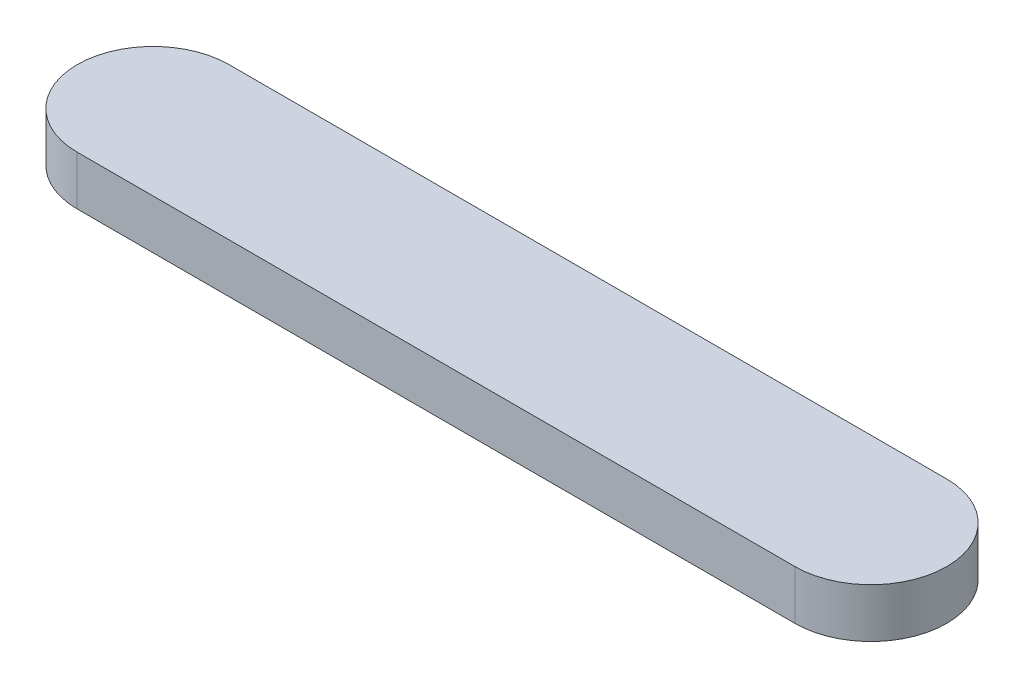
ISO-10303-21;
HEADER;
FILE_DESCRIPTION(('STEP AP214'),'2;1');
FILE_NAME('part.step','',(''),(''),'','','');
FILE_SCHEMA(('AUTOMOTIVE_DESIGN { 1 0 10303 214 1 1 1 1 }'));
ENDSEC;
DATA;
#1=APPLICATION_CONTEXT('core data for automotive mechanical design processes');
#2=APPLICATION_PROTOCOL_DEFINITION('international standard','automotive_design',2000,#1);
#3=PRODUCT_CONTEXT('',#1,'mechanical');
#4=PRODUCT('Part','Part','',(#3));
#5=PRODUCT_RELATED_PRODUCT_CATEGORY('part','',(#4));
#6=PRODUCT_DEFINITION_FORMATION('','',#4);
#7=PRODUCT_DEFINITION_CONTEXT('part definition',#1,'design');
#8=PRODUCT_DEFINITION('design','',#6,#7);
#9=PRODUCT_DEFINITION_SHAPE('','',#8);
#10=(LENGTH_UNIT() NAMED_UNIT(*) SI_UNIT(.MILLI.,.METRE.));
#11=(NAMED_UNIT(*) PLANE_ANGLE_UNIT() SI_UNIT($,.RADIAN.));
#12=(NAMED_UNIT(*) SI_UNIT($,.STERADIAN.) SOLID_ANGLE_UNIT());
#13=UNCERTAINTY_MEASURE_WITH_UNIT(LENGTH_MEASURE(1.E-05),#10,'distance_accuracy_value','');
#14=(GEOMETRIC_REPRESENTATION_CONTEXT(3) GLOBAL_UNCERTAINTY_ASSIGNED_CONTEXT((#13)) GLOBAL_UNIT_ASSIGNED_CONTEXT((#10,
#11,#12)) REPRESENTATION_CONTEXT('',''));
#15=CARTESIAN_POINT('',(0.,0.,0.));
#16=DIRECTION('',(0.,0.,1.));
#17=DIRECTION('',(1.,0.,0.));
#18=AXIS2_PLACEMENT_3D('',#15,#16,#17);
#19=CARTESIAN_POINT('',(0.,4.8,0.));
#20=DIRECTION('',(0.,-1.,0.));
#21=DIRECTION('',(0.,0.,-1.));
#22=AXIS2_PLACEMENT_3D('',#19,#20,#21);
#23=CYLINDRICAL_SURFACE('',#22,7.4);
#24=CARTESIAN_POINT('',(0.,0.,0.));
#25=DIRECTION('',(0.,1.,0.));
#26=DIRECTION('',(0.,0.,1.));
#27=AXIS2_PLACEMENT_3D('',#24,#25,#26);
#28=CIRCLE('',#27,7.4);
#29=CARTESIAN_POINT('',(0.,0.,-7.4));
#30=VERTEX_POINT('',#29);
#31=CARTESIAN_POINT('',(0.,0.,7.4));
#32=VERTEX_POINT('',#31);
#33=EDGE_CURVE('E102',#30,#32,#28,.T.);
#34=ORIENTED_EDGE('',*,*,#33,.T.);
#35=DIRECTION('',(0.,-1.,0.));
#36=VECTOR('',#35,1.);
#37=CARTESIAN_POINT('',(0.,4.8,7.4));
#38=LINE('',#37,#36);
#39=CARTESIAN_POINT('',(0.,4.8,7.4));
#40=VERTEX_POINT('',#39);
#41=EDGE_CURVE('E11',#40,#32,#38,.T.);
#42=ORIENTED_EDGE('',*,*,#41,.F.);
#43=CARTESIAN_POINT('',(0.,4.8,0.));
#44=DIRECTION('',(0.,1.,0.));
#45=DIRECTION('',(0.,0.,1.));
#46=AXIS2_PLACEMENT_3D('',#43,#44,#45);
#47=CIRCLE('',#46,7.4);
#48=CARTESIAN_POINT('',(0.,4.8,-7.4));
#49=VERTEX_POINT('',#48);
#50=EDGE_CURVE('E90',#49,#40,#47,.T.);
#51=ORIENTED_EDGE('',*,*,#50,.F.);
#52=DIRECTION('',(0.,-1.,0.));
#53=VECTOR('',#52,1.);
#54=CARTESIAN_POINT('',(0.,4.8,-7.4));
#55=LINE('',#54,#53);
#56=EDGE_CURVE('E98',#49,#30,#55,.T.);
#57=ORIENTED_EDGE('',*,*,#56,.T.);
#58=EDGE_LOOP('',(#34,#42,#51,#57));
#59=FACE_BOUND('',#58,.T.);
#60=ADVANCED_FACE('F39',(#59),#23,.T.);
#61=CARTESIAN_POINT('',(0.,4.8,7.4));
#62=DIRECTION('',(0.,0.,-1.));
#63=DIRECTION('',(-1.,0.,0.));
#64=AXIS2_PLACEMENT_3D('',#61,#62,#63);
#65=PLANE('',#64);
#66=DIRECTION('',(1.,0.,0.));
#67=VECTOR('',#66,1.);
#68=CARTESIAN_POINT('',(0.,0.,7.4));
#69=LINE('',#68,#67);
#70=CARTESIAN_POINT('',(70.,0.,7.4));
#71=VERTEX_POINT('',#70);
#72=EDGE_CURVE('E94',#32,#71,#69,.T.);
#73=ORIENTED_EDGE('',*,*,#72,.T.);
#74=DIRECTION('',(0.,-1.,0.));
#75=VECTOR('',#74,1.);
#76=CARTESIAN_POINT('',(70.,4.8,7.4));
#77=LINE('',#76,#75);
#78=CARTESIAN_POINT('',(70.,4.8,7.4));
#79=VERTEX_POINT('',#78);
#80=EDGE_CURVE('E47',#79,#71,#77,.T.);
#81=ORIENTED_EDGE('',*,*,#80,.F.);
#82=DIRECTION('',(1.,0.,0.));
#83=VECTOR('',#82,1.);
#84=CARTESIAN_POINT('',(0.,4.8,7.4));
#85=LINE('',#84,#83);
#86=EDGE_CURVE('E85',#40,#79,#85,.T.);
#87=ORIENTED_EDGE('',*,*,#86,.F.);
#88=ORIENTED_EDGE('',*,*,#41,.T.);
#89=EDGE_LOOP('',(#73,#81,#87,#88));
#90=FACE_BOUND('',#89,.T.);
#91=ADVANCED_FACE('F93',(#90),#65,.F.);
#92=CARTESIAN_POINT('',(70.,4.8,0.));
#93=DIRECTION('',(0.,-1.,0.));
#94=DIRECTION('',(0.,0.,-1.));
#95=AXIS2_PLACEMENT_3D('',#92,#93,#94);
#96=CYLINDRICAL_SURFACE('',#95,7.4);
#97=CARTESIAN_POINT('',(70.,0.,0.));
#98=DIRECTION('',(0.,1.,0.));
#99=DIRECTION('',(0.,0.,1.));
#100=AXIS2_PLACEMENT_3D('',#97,#98,#99);
#101=CIRCLE('',#100,7.4);
#102=CARTESIAN_POINT('',(70.,0.,-7.4));
#103=VERTEX_POINT('',#102);
#104=EDGE_CURVE('E72',#71,#103,#101,.T.);
#105=ORIENTED_EDGE('',*,*,#104,.T.);
#106=DIRECTION('',(0.,-1.,0.));
#107=VECTOR('',#106,1.);
#108=CARTESIAN_POINT('',(70.,4.8,-7.4));
#109=LINE('',#108,#107);
#110=CARTESIAN_POINT('',(70.,4.8,-7.4));
#111=VERTEX_POINT('',#110);
#112=EDGE_CURVE('E95',#111,#103,#109,.T.);
#113=ORIENTED_EDGE('',*,*,#112,.F.);
#114=CARTESIAN_POINT('',(70.,4.8,0.));
#115=DIRECTION('',(0.,1.,0.));
#116=DIRECTION('',(0.,0.,1.));
#117=AXIS2_PLACEMENT_3D('',#114,#115,#116);
#118=CIRCLE('',#117,7.4);
#119=EDGE_CURVE('E88',#79,#111,#118,.T.);
#120=ORIENTED_EDGE('',*,*,#119,.F.);
#121=ORIENTED_EDGE('',*,*,#80,.T.);
#122=EDGE_LOOP('',(#105,#113,#120,#121));
#123=FACE_BOUND('',#122,.T.);
#124=ADVANCED_FACE('F96',(#123),#96,.T.);
#125=CARTESIAN_POINT('',(0.,4.8,-7.4));
#126=DIRECTION('',(0.,0.,1.));
#127=DIRECTION('',(1.,0.,0.));
#128=AXIS2_PLACEMENT_3D('',#125,#126,#127);
#129=PLANE('',#128);
#130=DIRECTION('',(-1.,0.,0.));
#131=VECTOR('',#130,1.);
#132=CARTESIAN_POINT('',(0.,0.,-7.4));
#133=LINE('',#132,#131);
#134=EDGE_CURVE('E78',#103,#30,#133,.T.);
#135=ORIENTED_EDGE('',*,*,#134,.T.);
#136=ORIENTED_EDGE('',*,*,#56,.F.);
#137=DIRECTION('',(-1.,0.,0.));
#138=VECTOR('',#137,1.);
#139=CARTESIAN_POINT('',(0.,4.8,-7.4));
#140=LINE('',#139,#138);
#141=EDGE_CURVE('E55',#111,#49,#140,.T.);
#142=ORIENTED_EDGE('',*,*,#141,.F.);
#143=ORIENTED_EDGE('',*,*,#112,.T.);
#144=EDGE_LOOP('',(#135,#136,#142,#143));
#145=FACE_BOUND('',#144,.T.);
#146=ADVANCED_FACE('F109',(#145),#129,.F.);
#147=CARTESIAN_POINT('',(0.,4.8,0.));
#148=DIRECTION('',(0.,1.,0.));
#149=DIRECTION('',(0.,0.,1.));
#150=AXIS2_PLACEMENT_3D('',#147,#148,#149);
#151=PLANE('',#150);
#152=ORIENTED_EDGE('',*,*,#50,.T.);
#153=ORIENTED_EDGE('',*,*,#86,.T.);
#154=ORIENTED_EDGE('',*,*,#119,.T.);
#155=ORIENTED_EDGE('',*,*,#141,.T.);
#156=EDGE_LOOP('',(#152,#153,#154,#155));
#157=FACE_BOUND('',#156,.T.);
#158=ADVANCED_FACE('F86',(#157),#151,.T.);
#159=CARTESIAN_POINT('',(0.,0.,0.));
#160=DIRECTION('',(0.,1.,0.));
#161=DIRECTION('',(0.,0.,1.));
#162=AXIS2_PLACEMENT_3D('',#159,#160,#161);
#163=PLANE('',#162);
#164=ORIENTED_EDGE('',*,*,#33,.F.);
#165=ORIENTED_EDGE('',*,*,#134,.F.);
#166=ORIENTED_EDGE('',*,*,#104,.F.);
#167=ORIENTED_EDGE('',*,*,#72,.F.);
#168=EDGE_LOOP('',(#164,#165,#166,#167));
#169=FACE_BOUND('',#168,.T.);
#170=ADVANCED_FACE('F112',(#169),#163,.F.);
#171=CLOSED_SHELL('',(#60,#91,#124,#146,#158,#170));
#172=MANIFOLD_SOLID_BREP('B2',#171);
#173=ADVANCED_BREP_SHAPE_REPRESENTATION('',(#18,#172),#14);
#174=SHAPE_DEFINITION_REPRESENTATION(#9,#173);
ENDSEC;
END-ISO-10303-21;
